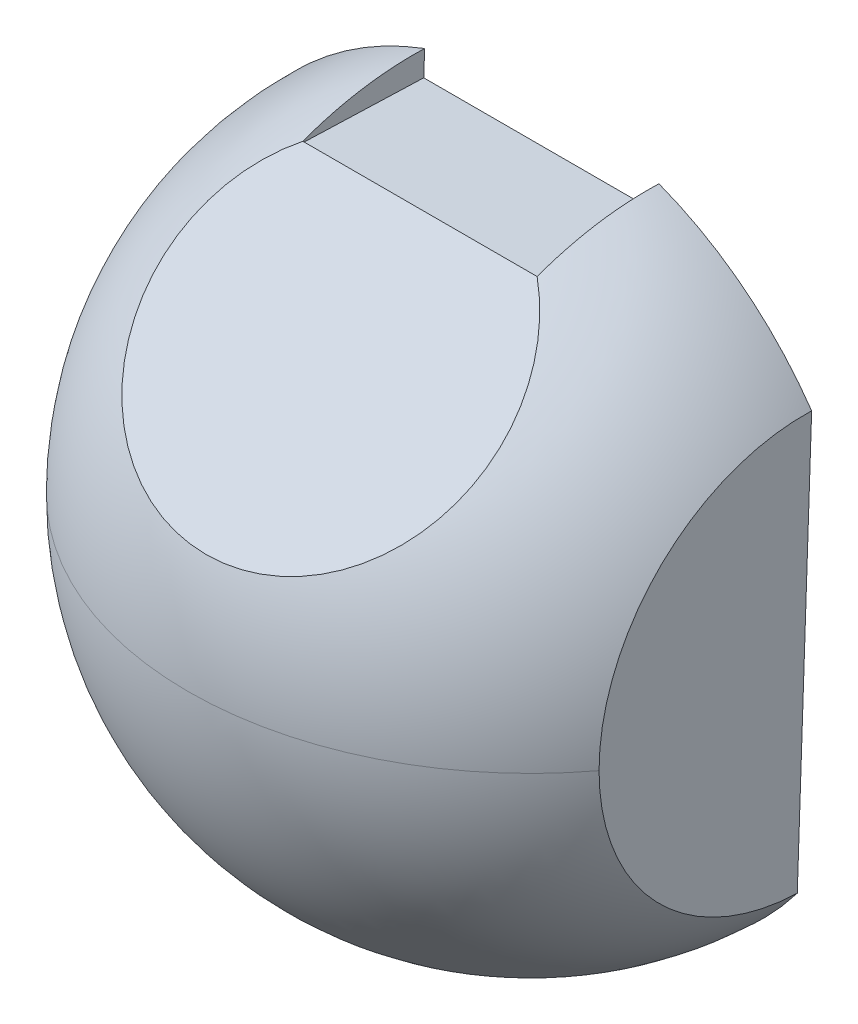
ISO-10303-21;
HEADER;
FILE_DESCRIPTION(('STEP AP214'),'2;1');
FILE_NAME('part.step','',(''),(''),'','','');
FILE_SCHEMA(('AUTOMOTIVE_DESIGN { 1 0 10303 214 1 1 1 1 }'));
ENDSEC;
DATA;
#1=APPLICATION_CONTEXT('core data for automotive mechanical design processes');
#2=APPLICATION_PROTOCOL_DEFINITION('international standard','automotive_design',2000,#1);
#3=PRODUCT_CONTEXT('',#1,'mechanical');
#4=PRODUCT('Part','Part','',(#3));
#5=PRODUCT_RELATED_PRODUCT_CATEGORY('part','',(#4));
#6=PRODUCT_DEFINITION_FORMATION('','',#4);
#7=PRODUCT_DEFINITION_CONTEXT('part definition',#1,'design');
#8=PRODUCT_DEFINITION('design','',#6,#7);
#9=PRODUCT_DEFINITION_SHAPE('','',#8);
#10=(LENGTH_UNIT() NAMED_UNIT(*) SI_UNIT(.MILLI.,.METRE.));
#11=(NAMED_UNIT(*) PLANE_ANGLE_UNIT() SI_UNIT($,.RADIAN.));
#12=(NAMED_UNIT(*) SI_UNIT($,.STERADIAN.) SOLID_ANGLE_UNIT());
#13=UNCERTAINTY_MEASURE_WITH_UNIT(LENGTH_MEASURE(1.E-05),#10,'distance_accuracy_value','');
#14=(GEOMETRIC_REPRESENTATION_CONTEXT(3) GLOBAL_UNCERTAINTY_ASSIGNED_CONTEXT((#13)) GLOBAL_UNIT_ASSIGNED_CONTEXT((#10,
#11,#12)) REPRESENTATION_CONTEXT('',''));
#15=CARTESIAN_POINT('',(0.,0.,0.));
#16=DIRECTION('',(0.,0.,1.));
#17=DIRECTION('',(1.,0.,0.));
#18=AXIS2_PLACEMENT_3D('',#15,#16,#17);
#19=CARTESIAN_POINT('',(14.2598514294531,-20.4423351170931,13.2659633857933));
#20=DIRECTION('',(-9.10736523873779E-05,-0.0350367531214772,-0.999386020332631));
#21=DIRECTION('',(0.,-0.99938602447729,0.0350367532667818));
#22=AXIS2_PLACEMENT_3D('',#19,#20,#21);
#23=PLANE('',#22);
#24=DIRECTION('',(3.19288542979789E-06,-0.999386024482384,0.0350367529760037));
#25=VECTOR('',#24,1.);
#26=CARTESIAN_POINT('',(-14.2574161236256,-25.8338358027963,13.4575788840046));
#27=LINE('',#26,#25);
#28=CARTESIAN_POINT('',(-14.2574161236256,-25.8338358027963,13.4575788840046));
#29=VERTEX_POINT('',#28);
#30=CARTESIAN_POINT('',(-14.2574156103928,-25.994479741968,13.463210783867));
#31=VERTEX_POINT('',#30);
#32=EDGE_CURVE('E253',#29,#31,#27,.T.);
#33=ORIENTED_EDGE('',*,*,#32,.F.);
#34=DIRECTION('',(0.999999995847698,0.,-9.11296037329998E-05));
#35=VECTOR('',#34,1.);
#36=CARTESIAN_POINT('',(14.2598686544728,-25.8338358027963,13.4549801151324));
#37=LINE('',#36,#35);
#38=CARTESIAN_POINT('',(14.2598686544727,-25.8338358027963,13.4549801151324));
#39=VERTEX_POINT('',#38);
#40=EDGE_CURVE('E198',#29,#39,#37,.T.);
#41=ORIENTED_EDGE('',*,*,#40,.T.);
#42=DIRECTION('',(3.19288542979789E-06,-0.999386024482384,0.0350367529760037));
#43=VECTOR('',#42,1.);
#44=CARTESIAN_POINT('',(14.2598686544728,-25.8338358027963,13.4549801151324));
#45=LINE('',#44,#43);
#46=CARTESIAN_POINT('',(14.2598691677056,-25.994479741968,13.4606120149949));
#47=VERTEX_POINT('',#46);
#48=EDGE_CURVE('E213',#39,#47,#45,.T.);
#49=ORIENTED_EDGE('',*,*,#48,.T.);
#50=DIRECTION('',(0.999999995847698,0.,-9.11296037329823E-05));
#51=VECTOR('',#50,1.);
#52=CARTESIAN_POINT('',(-14.2574156103928,-25.994479741968,13.463210783867));
#53=LINE('',#52,#51);
#54=EDGE_CURVE('E217',#31,#47,#53,.T.);
#55=ORIENTED_EDGE('',*,*,#54,.F.);
#56=EDGE_LOOP('',(#33,#41,#49,#55));
#57=FACE_BOUND('',#56,.T.);
#58=ADVANCED_FACE('F49',(#57),#23,.T.);
#59=CARTESIAN_POINT('',(0.,-62.5997275361334,0.));
#60=DIRECTION('',(0.,1.,0.));
#61=DIRECTION('',(1.,0.,0.));
#62=AXIS2_PLACEMENT_3D('',#59,#60,#61);
#63=SPHERICAL_SURFACE('',#62,41.666667);
#64=CARTESIAN_POINT('',(14.2586423890492,-62.5997275361334,-0.00129938443608005));
#65=DIRECTION('',(0.999999995847698,0.,-9.11296037330042E-05));
#66=DIRECTION('',(9.10736523873821E-05,0.0350367531214773,0.999386020332631));
#67=AXIS2_PLACEMENT_3D('',#64,#65,#66);
#68=CIRCLE('',#67,39.1510185617399);
#69=CARTESIAN_POINT('',(14.2585173843326,-23.4727467412801,-1.37302395054232));
#70=VERTEX_POINT('',#69);
#71=EDGE_CURVE('E235',#70,#39,#68,.T.);
#72=ORIENTED_EDGE('',*,*,#71,.T.);
#73=CARTESIAN_POINT('',(0.00221509637557768,-35.6039582636471,24.3070997309474));
#74=DIRECTION('',(6.09776070031096E-05,0.743144825477396,0.669130603580423));
#75=DIRECTION('',(0.,-0.669130604824427,0.743144826859002));
#76=AXIS2_PLACEMENT_3D('',#73,#74,#75);
#77=CIRCLE('',#76,20.4084413427067);
#78=EDGE_CURVE('E11',#39,#29,#77,.F.);
#79=ORIENTED_EDGE('',*,*,#78,.T.);
#80=CARTESIAN_POINT('',(-14.2586423890492,-62.5997275361334,0.00129938443608005));
#81=DIRECTION('',(-0.999999995847698,0.,9.11296037330042E-05));
#82=DIRECTION('',(-9.10736523873821E-05,-0.0350367531214744,-0.999386020332631));
#83=AXIS2_PLACEMENT_3D('',#80,#81,#82);
#84=CIRCLE('',#83,39.1510185617399);
#85=CARTESIAN_POINT('',(-14.2587673937659,-23.4727467412801,-1.37042518167016));
#86=VERTEX_POINT('',#85);
#87=EDGE_CURVE('E190',#29,#86,#84,.T.);
#88=ORIENTED_EDGE('',*,*,#87,.T.);
#89=CARTESIAN_POINT('',(0.,-62.5997275361334,0.));
#90=DIRECTION('',(-9.10736523873779E-05,-0.0350367531214772,-0.999386020332631));
#91=DIRECTION('',(-0.999999995847698,0.,9.1129603733E-05));
#92=AXIS2_PLACEMENT_3D('',#89,#90,#91);
#93=CIRCLE('',#92,41.666667);
#94=CARTESIAN_POINT('',(-33.3334132837263,-37.6150767241966,-0.872881177925133));
#95=VERTEX_POINT('',#94);
#96=EDGE_CURVE('E175',#95,#86,#93,.T.);
#97=ORIENTED_EDGE('',*,*,#96,.F.);
#98=CARTESIAN_POINT('',(-33.3333334615899,-62.5997275361334,0.00303765348206789));
#99=DIRECTION('',(0.999999995847698,0.,-9.11296037329802E-05));
#100=DIRECTION('',(9.10736523873581E-05,0.0350367531214772,0.999386020332631));
#101=AXIS2_PLACEMENT_3D('',#98,#99,#100);
#102=CIRCLE('',#101,25.0000002);
#103=CARTESIAN_POINT('',(-33.3310552214784,-62.5997275361334,25.0030377496745));
#104=VERTEX_POINT('',#103);
#105=EDGE_CURVE('E188',#95,#104,#102,.T.);
#106=ORIENTED_EDGE('',*,*,#105,.T.);
#107=CARTESIAN_POINT('',(0.,-62.5997275361334,0.));
#108=DIRECTION('',(0.,1.,0.));
#109=DIRECTION('',(-1.,0.,0.));
#110=AXIS2_PLACEMENT_3D('',#107,#108,#109);
#111=CIRCLE('',#110,41.666667);
#112=CARTESIAN_POINT('',(0.,-62.5997275361334,41.666667));
#113=VERTEX_POINT('',#112);
#114=EDGE_CURVE('E197',#104,#113,#111,.T.);
#115=ORIENTED_EDGE('',*,*,#114,.T.);
#116=CARTESIAN_POINT('',(0.,-62.5997275361334,0.));
#117=DIRECTION('',(0.,-1.,0.));
#118=DIRECTION('',(0.,0.,-1.));
#119=AXIS2_PLACEMENT_3D('',#116,#117,#118);
#120=CIRCLE('',#119,41.666667);
#121=CARTESIAN_POINT('',(33.3356117017014,-62.5997275361334,24.9969624427104));
#122=VERTEX_POINT('',#121);
#123=EDGE_CURVE('E154',#122,#113,#120,.T.);
#124=ORIENTED_EDGE('',*,*,#123,.F.);
#125=CARTESIAN_POINT('',(33.3333334615899,-62.5997275361334,-0.00303765348206789));
#126=DIRECTION('',(-0.999999995847698,0.,9.11296037329802E-05));
#127=DIRECTION('',(-9.10736523873581E-05,-0.0350367531214774,-0.999386020332631));
#128=AXIS2_PLACEMENT_3D('',#125,#126,#127);
#129=CIRCLE('',#128,25.0000002);
#130=CARTESIAN_POINT('',(33.3332536394536,-37.6150767241966,-0.878956484889268));
#131=VERTEX_POINT('',#130);
#132=EDGE_CURVE('E227',#122,#131,#129,.T.);
#133=ORIENTED_EDGE('',*,*,#132,.T.);
#134=CARTESIAN_POINT('',(0.,-62.5997275361334,0.));
#135=DIRECTION('',(-9.10736523873779E-05,-0.0350367531214772,-0.999386020332631));
#136=DIRECTION('',(-0.999999995847698,0.,9.1129603733E-05));
#137=AXIS2_PLACEMENT_3D('',#134,#135,#136);
#138=CIRCLE('',#137,41.666667);
#139=EDGE_CURVE('E231',#70,#131,#138,.T.);
#140=ORIENTED_EDGE('',*,*,#139,.F.);
#141=EDGE_LOOP('',(#72,#79,#88,#97,#106,#115,#124,#133,#140));
#142=FACE_BOUND('',#141,.T.);
#143=ADVANCED_FACE('F187',(#142),#63,.T.);
#144=CARTESIAN_POINT('',(-0.000199751040257114,-0.0768458022683134,-2.19194456295436));
#145=DIRECTION('',(9.10736523878124E-05,0.0350367531214781,0.999386020332631));
#146=DIRECTION('',(0.9999966216425,-0.00259936599697722,0.));
#147=AXIS2_PLACEMENT_3D('',#144,#145,#146);
#148=PLANE('',#147);
#149=DIRECTION('',(0.999999995852795,-3.19092508804742E-06,-9.10177353944788E-05));
#150=VECTOR('',#149,1.);
#151=CARTESIAN_POINT('',(-16.6977987223002,-46.0227780863122,-0.579637641590468));
#152=LINE('',#151,#150);
#153=CARTESIAN_POINT('',(-16.6977987223002,-46.0227780863122,-0.579637641590467));
#154=VERTEX_POINT('',#153);
#155=CARTESIAN_POINT('',(16.6973992202197,-46.0228846478876,-0.582677196892853));
#156=VERTEX_POINT('',#155);
#157=EDGE_CURVE('E223',#154,#156,#152,.T.);
#158=ORIENTED_EDGE('',*,*,#157,.F.);
#159=DIRECTION('',(0.,0.99938602447729,-0.0350367532667827));
#160=VECTOR('',#159,1.);
#161=CARTESIAN_POINT('',(-16.6977987223002,-79.5294839718656,0.595049774624714));
#162=LINE('',#161,#160);
#163=CARTESIAN_POINT('',(-16.6977987223002,-79.5294839718656,0.595049774624714));
#164=VERTEX_POINT('',#163);
#165=EDGE_CURVE('E248',#164,#154,#162,.T.);
#166=ORIENTED_EDGE('',*,*,#165,.F.);
#167=DIRECTION('',(-0.999999995852795,3.19092508778146E-06,9.10177353944913E-05));
#168=VECTOR('',#167,1.);
#169=CARTESIAN_POINT('',(16.6973992202197,-79.529590533441,0.592010219322329));
#170=LINE('',#169,#168);
#171=CARTESIAN_POINT('',(16.6973992202197,-79.529590533441,0.592010219322329));
#172=VERTEX_POINT('',#171);
#173=EDGE_CURVE('E249',#172,#164,#170,.T.);
#174=ORIENTED_EDGE('',*,*,#173,.F.);
#175=DIRECTION('',(0.,-0.99938602447729,0.0350367532667827));
#176=VECTOR('',#175,1.);
#177=CARTESIAN_POINT('',(16.6973992202197,-46.0228846478876,-0.582677196892853));
#178=LINE('',#177,#176);
#179=EDGE_CURVE('E258',#156,#172,#178,.T.);
#180=ORIENTED_EDGE('',*,*,#179,.F.);
#181=EDGE_LOOP('',(#158,#166,#174,#180));
#182=FACE_BOUND('',#181,.T.);
#183=DIRECTION('',(-3.19288542795622E-06,0.999386024482384,-0.035036752975995));
#184=VECTOR('',#183,1.);
#185=CARTESIAN_POINT('',(14.2585270904078,-26.5107874744469,-1.26651547424648));
#186=LINE('',#185,#184);
#187=CARTESIAN_POINT('',(14.2585270904078,-26.5107874744469,-1.26651547424648));
#188=VERTEX_POINT('',#187);
#189=EDGE_CURVE('E243',#188,#70,#186,.T.);
#190=ORIENTED_EDGE('',*,*,#189,.T.);
#191=ORIENTED_EDGE('',*,*,#139,.T.);
#192=DIRECTION('',(3.19288542799705E-06,-0.999386024482384,0.0350367529759949));
#193=VECTOR('',#192,1.);
#194=CARTESIAN_POINT('',(33.3332536394536,-37.6150767241966,-0.878956484889265));
#195=LINE('',#194,#193);
#196=CARTESIAN_POINT('',(33.3334132837263,-87.5843783480702,0.872881177925136));
#197=VERTEX_POINT('',#196);
#198=EDGE_CURVE('E182',#131,#197,#195,.T.);
#199=ORIENTED_EDGE('',*,*,#198,.T.);
#200=CARTESIAN_POINT('',(0.,-62.5997275361334,0.));
#201=DIRECTION('',(9.1073652387378E-05,0.0350367531214773,0.999386020332631));
#202=DIRECTION('',(-3.19288542805118E-06,0.999386024482384,-0.0350367529759941));
#203=AXIS2_PLACEMENT_3D('',#200,#201,#202);
#204=CIRCLE('',#203,41.666667);
#205=CARTESIAN_POINT('',(-33.3332536394536,-87.5843783480702,0.878956484889271));
#206=VERTEX_POINT('',#205);
#207=EDGE_CURVE('E177',#206,#197,#204,.T.);
#208=ORIENTED_EDGE('',*,*,#207,.F.);
#209=DIRECTION('',(-3.19288542799705E-06,0.999386024482384,-0.0350367529759949));
#210=VECTOR('',#209,1.);
#211=CARTESIAN_POINT('',(-33.3332536394536,-87.5843783480702,0.878956484889346));
#212=LINE('',#211,#210);
#213=EDGE_CURVE('E173',#206,#95,#212,.T.);
#214=ORIENTED_EDGE('',*,*,#213,.T.);
#215=ORIENTED_EDGE('',*,*,#96,.T.);
#216=DIRECTION('',(3.19288542795622E-06,-0.999386024482384,0.0350367529759949));
#217=VECTOR('',#216,1.);
#218=CARTESIAN_POINT('',(-14.2587673937659,-23.4727467412801,-1.37042518167015));
#219=LINE('',#218,#217);
#220=CARTESIAN_POINT('',(-14.2587576876906,-26.5107874744469,-1.26391670537431));
#221=VERTEX_POINT('',#220);
#222=EDGE_CURVE('E226',#86,#221,#219,.T.);
#223=ORIENTED_EDGE('',*,*,#222,.T.);
#224=DIRECTION('',(0.999999995847698,0.,-9.112960373343E-05));
#225=VECTOR('',#224,1.);
#226=CARTESIAN_POINT('',(-14.2587576876906,-26.5107874744469,-1.26391670537431));
#227=LINE('',#226,#225);
#228=EDGE_CURVE('E59',#221,#188,#227,.T.);
#229=ORIENTED_EDGE('',*,*,#228,.T.);
#230=EDGE_LOOP('',(#190,#191,#199,#208,#214,#215,#223,#229));
#231=FACE_BOUND('',#230,.T.);
#232=ADVANCED_FACE('F51',(#182,#231),#148,.F.);
#233=CARTESIAN_POINT('',(-0.000115298641379792,-26.5107874744469,-1.2652160898104));
#234=DIRECTION('',(-3.19288542805117E-06,0.999386024482384,-0.035036752975994));
#235=DIRECTION('',(-0.999999995847698,0.,9.11296037330001E-05));
#236=AXIS2_PLACEMENT_3D('',#233,#234,#235);
#237=PLANE('',#236);
#238=ORIENTED_EDGE('',*,*,#228,.F.);
#239=DIRECTION('',(9.10736523873574E-05,0.0350367531214773,0.999386020332631));
#240=VECTOR('',#239,1.);
#241=CARTESIAN_POINT('',(-14.2587576876906,-26.5107874744469,-1.2639167053743));
#242=LINE('',#241,#240);
#243=EDGE_CURVE('E218',#221,#31,#242,.T.);
#244=ORIENTED_EDGE('',*,*,#243,.T.);
#245=ORIENTED_EDGE('',*,*,#54,.T.);
#246=DIRECTION('',(-9.10736523873573E-05,-0.0350367531214772,-0.999386020332631));
#247=VECTOR('',#246,1.);
#248=CARTESIAN_POINT('',(14.2598691677056,-25.994479741968,13.4606120149949));
#249=LINE('',#248,#247);
#250=EDGE_CURVE('E267',#47,#188,#249,.T.);
#251=ORIENTED_EDGE('',*,*,#250,.T.);
#252=EDGE_LOOP('',(#238,#244,#245,#251));
#253=FACE_BOUND('',#252,.T.);
#254=ADVANCED_FACE('F397',(#253),#237,.T.);
#255=CARTESIAN_POINT('',(14.2598514294531,-20.4423351170931,13.2659633857933));
#256=DIRECTION('',(-0.999999995847698,0.,9.1129603733E-05));
#257=DIRECTION('',(0.,1.,0.));
#258=AXIS2_PLACEMENT_3D('',#255,#256,#257);
#259=PLANE('',#258);
#260=ORIENTED_EDGE('',*,*,#189,.F.);
#261=ORIENTED_EDGE('',*,*,#250,.F.);
#262=ORIENTED_EDGE('',*,*,#48,.F.);
#263=ORIENTED_EDGE('',*,*,#71,.F.);
#264=EDGE_LOOP('',(#260,#261,#262,#263));
#265=FACE_BOUND('',#264,.T.);
#266=ADVANCED_FACE('F294',(#265),#259,.T.);
#267=CARTESIAN_POINT('',(-14.2574333486454,-20.4423351170931,13.2685621546654));
#268=DIRECTION('',(0.999999995847698,0.,-9.1129603733E-05));
#269=DIRECTION('',(0.,-1.,0.));
#270=AXIS2_PLACEMENT_3D('',#267,#268,#269);
#271=PLANE('',#270);
#272=ORIENTED_EDGE('',*,*,#222,.F.);
#273=ORIENTED_EDGE('',*,*,#87,.F.);
#274=ORIENTED_EDGE('',*,*,#32,.T.);
#275=ORIENTED_EDGE('',*,*,#243,.F.);
#276=EDGE_LOOP('',(#272,#273,#274,#275));
#277=FACE_BOUND('',#276,.T.);
#278=ADVANCED_FACE('F412',(#277),#271,.T.);
#279=CARTESIAN_POINT('',(33.3333334615899,-62.5997275361334,-0.00303765348206789));
#280=DIRECTION('',(0.999999995847698,0.,-9.1129603733E-05));
#281=DIRECTION('',(0.,-1.,0.));
#282=AXIS2_PLACEMENT_3D('',#279,#280,#281);
#283=PLANE('',#282);
#284=ORIENTED_EDGE('',*,*,#198,.F.);
#285=ORIENTED_EDGE('',*,*,#132,.F.);
#286=CARTESIAN_POINT('',(33.3333334615899,-62.5997275361334,-0.00303765348206789));
#287=DIRECTION('',(-0.999999995847698,0.,9.11296037329802E-05));
#288=DIRECTION('',(-9.10736523873581E-05,-0.0350367531214774,-0.999386020332631));
#289=AXIS2_PLACEMENT_3D('',#286,#287,#288);
#290=CIRCLE('',#289,25.0000002);
#291=EDGE_CURVE('E146',#197,#122,#290,.T.);
#292=ORIENTED_EDGE('',*,*,#291,.F.);
#293=EDGE_LOOP('',(#284,#285,#292));
#294=FACE_BOUND('',#293,.T.);
#295=ADVANCED_FACE('F296',(#294),#283,.T.);
#296=CARTESIAN_POINT('',(-33.3333334615899,-62.5997275361334,0.00303765348206789));
#297=DIRECTION('',(-0.999999995847698,0.,9.1129603733E-05));
#298=DIRECTION('',(0.,1.,0.));
#299=AXIS2_PLACEMENT_3D('',#296,#297,#298);
#300=PLANE('',#299);
#301=ORIENTED_EDGE('',*,*,#213,.F.);
#302=CARTESIAN_POINT('',(-33.3333334615899,-62.5997275361334,0.00303765348206789));
#303=DIRECTION('',(0.999999995847698,0.,-9.11296037329802E-05));
#304=DIRECTION('',(9.10736523873581E-05,0.0350367531214772,0.999386020332631));
#305=AXIS2_PLACEMENT_3D('',#302,#303,#304);
#306=CIRCLE('',#305,25.0000002);
#307=EDGE_CURVE('E195',#104,#206,#306,.T.);
#308=ORIENTED_EDGE('',*,*,#307,.F.);
#309=ORIENTED_EDGE('',*,*,#105,.F.);
#310=EDGE_LOOP('',(#301,#308,#309));
#311=FACE_BOUND('',#310,.T.);
#312=ADVANCED_FACE('F194',(#311),#300,.T.);
#313=CARTESIAN_POINT('',(0.,-62.5997275361334,0.));
#314=DIRECTION('',(0.,1.,0.));
#315=DIRECTION('',(1.,0.,0.));
#316=AXIS2_PLACEMENT_3D('',#313,#314,#315);
#317=SPHERICAL_SURFACE('',#316,41.666667);
#318=ORIENTED_EDGE('',*,*,#114,.F.);
#319=ORIENTED_EDGE('',*,*,#307,.T.);
#320=ORIENTED_EDGE('',*,*,#207,.T.);
#321=ORIENTED_EDGE('',*,*,#291,.T.);
#322=ORIENTED_EDGE('',*,*,#123,.T.);
#323=EDGE_LOOP('',(#318,#319,#320,#321,#322));
#324=FACE_BOUND('',#323,.T.);
#325=ADVANCED_FACE('F297',(#324),#317,.T.);
#326=CARTESIAN_POINT('',(-16.6973433540382,-45.8475943207048,4.41729246007269));
#327=DIRECTION('',(-0.999999995852795,3.19092508781652E-06,9.10177353944825E-05));
#328=DIRECTION('',(3.19092510103369E-06,0.999999999994909,0.));
#329=AXIS2_PLACEMENT_3D('',#326,#327,#328);
#330=PLANE('',#329);
#331=ORIENTED_EDGE('',*,*,#165,.T.);
#332=DIRECTION('',(-9.10736523875855E-05,-0.0350367531214779,-0.999386020332631));
#333=VECTOR('',#332,1.);
#334=CARTESIAN_POINT('',(-16.6973433540382,-45.8475943207048,4.41729246007269));
#335=LINE('',#334,#333);
#336=CARTESIAN_POINT('',(-16.6973433540382,-45.8475943207048,4.41729246007269));
#337=VERTEX_POINT('',#336);
#338=EDGE_CURVE('E207',#337,#154,#335,.T.);
#339=ORIENTED_EDGE('',*,*,#338,.F.);
#340=DIRECTION('',(0.,0.99938602447729,-0.0350367532667827));
#341=VECTOR('',#340,1.);
#342=CARTESIAN_POINT('',(-16.6973433540382,-79.3543002062582,5.59197987628787));
#343=LINE('',#342,#341);
#344=CARTESIAN_POINT('',(-16.6973433540382,-79.3543002062582,5.59197987628787));
#345=VERTEX_POINT('',#344);
#346=EDGE_CURVE('E192',#345,#337,#343,.T.);
#347=ORIENTED_EDGE('',*,*,#346,.F.);
#348=DIRECTION('',(-9.10736523875855E-05,-0.0350367531214797,-0.999386020332631));
#349=VECTOR('',#348,1.);
#350=CARTESIAN_POINT('',(-16.6973433540382,-79.3543002062582,5.59197987628787));
#351=LINE('',#350,#349);
#352=EDGE_CURVE('E244',#345,#164,#351,.T.);
#353=ORIENTED_EDGE('',*,*,#352,.T.);
#354=EDGE_LOOP('',(#331,#339,#347,#353));
#355=FACE_BOUND('',#354,.T.);
#356=ADVANCED_FACE('F325',(#355),#330,.F.);
#357=CARTESIAN_POINT('',(16.6978545884816,-79.3544067678336,5.58894032098549));
#358=DIRECTION('',(0.,-0.99938602447729,0.0350367532667827));
#359=DIRECTION('',(-1.,0.,0.));
#360=AXIS2_PLACEMENT_3D('',#357,#358,#359);
#361=PLANE('',#360);
#362=ORIENTED_EDGE('',*,*,#173,.T.);
#363=ORIENTED_EDGE('',*,*,#352,.F.);
#364=DIRECTION('',(-0.999999995852795,3.19092508804742E-06,9.1017735394483E-05));
#365=VECTOR('',#364,1.);
#366=CARTESIAN_POINT('',(16.6978545884816,-79.3544067678336,5.58894032098549));
#367=LINE('',#366,#365);
#368=CARTESIAN_POINT('',(16.6978545884816,-79.3544067678336,5.58894032098549));
#369=VERTEX_POINT('',#368);
#370=EDGE_CURVE('E239',#369,#345,#367,.T.);
#371=ORIENTED_EDGE('',*,*,#370,.F.);
#372=DIRECTION('',(-9.10736523875855E-05,-0.0350367531214779,-0.999386020332631));
#373=VECTOR('',#372,1.);
#374=CARTESIAN_POINT('',(16.6978545884816,-79.3544067678336,5.58894032098549));
#375=LINE('',#374,#373);
#376=EDGE_CURVE('E254',#369,#172,#375,.T.);
#377=ORIENTED_EDGE('',*,*,#376,.T.);
#378=EDGE_LOOP('',(#362,#363,#371,#377));
#379=FACE_BOUND('',#378,.T.);
#380=ADVANCED_FACE('F323',(#379),#361,.F.);
#381=CARTESIAN_POINT('',(16.6978545884816,-45.8477008822802,4.4142529047703));
#382=DIRECTION('',(0.999999995852795,-3.19092508781653E-06,-9.10177353944825E-05));
#383=DIRECTION('',(0.,-0.99938602447729,0.0350367532667828));
#384=AXIS2_PLACEMENT_3D('',#381,#382,#383);
#385=PLANE('',#384);
#386=ORIENTED_EDGE('',*,*,#179,.T.);
#387=ORIENTED_EDGE('',*,*,#376,.F.);
#388=DIRECTION('',(0.,-0.99938602447729,0.0350367532667827));
#389=VECTOR('',#388,1.);
#390=CARTESIAN_POINT('',(16.6978545884816,-45.8477008822802,4.4142529047703));
#391=LINE('',#390,#389);
#392=CARTESIAN_POINT('',(16.6978545884816,-45.8477008822802,4.4142529047703));
#393=VERTEX_POINT('',#392);
#394=EDGE_CURVE('E273',#393,#369,#391,.T.);
#395=ORIENTED_EDGE('',*,*,#394,.F.);
#396=DIRECTION('',(-9.10736523875855E-05,-0.0350367531214797,-0.999386020332631));
#397=VECTOR('',#396,1.);
#398=CARTESIAN_POINT('',(16.6978545884816,-45.8477008822802,4.4142529047703));
#399=LINE('',#398,#397);
#400=EDGE_CURVE('E219',#393,#156,#399,.T.);
#401=ORIENTED_EDGE('',*,*,#400,.T.);
#402=EDGE_LOOP('',(#386,#387,#395,#401));
#403=FACE_BOUND('',#402,.T.);
#404=ADVANCED_FACE('F320',(#403),#385,.F.);
#405=CARTESIAN_POINT('',(16.6978545884816,-45.8477008822802,4.4142529047703));
#406=DIRECTION('',(0.,0.99938602447729,-0.0350367532667827));
#407=DIRECTION('',(-1.,0.,0.));
#408=AXIS2_PLACEMENT_3D('',#405,#406,#407);
#409=PLANE('',#408);
#410=ORIENTED_EDGE('',*,*,#157,.T.);
#411=ORIENTED_EDGE('',*,*,#400,.F.);
#412=DIRECTION('',(0.999999995852795,-3.19092508778146E-06,-9.10177353944664E-05));
#413=VECTOR('',#412,1.);
#414=CARTESIAN_POINT('',(-16.6973433540382,-45.8475943207048,4.41729246007269));
#415=LINE('',#414,#413);
#416=EDGE_CURVE('E212',#337,#393,#415,.T.);
#417=ORIENTED_EDGE('',*,*,#416,.F.);
#418=ORIENTED_EDGE('',*,*,#338,.T.);
#419=EDGE_LOOP('',(#410,#411,#417,#418));
#420=FACE_BOUND('',#419,.T.);
#421=ADVANCED_FACE('F317',(#420),#409,.F.);
#422=CARTESIAN_POINT('',(0.000255617221681926,0.098337963339077,2.8049855387088));
#423=DIRECTION('',(-9.10736523878223E-05,-0.0350367531214781,-0.999386020332631));
#424=DIRECTION('',(0.,-0.99938602447729,0.0350367532667827));
#425=AXIS2_PLACEMENT_3D('',#422,#423,#424);
#426=PLANE('',#425);
#427=ORIENTED_EDGE('',*,*,#346,.T.);
#428=ORIENTED_EDGE('',*,*,#416,.T.);
#429=ORIENTED_EDGE('',*,*,#394,.T.);
#430=ORIENTED_EDGE('',*,*,#370,.T.);
#431=EDGE_LOOP('',(#427,#428,#429,#430));
#432=FACE_BOUND('',#431,.T.);
#433=ADVANCED_FACE('F312',(#432),#426,.T.);
#434=CARTESIAN_POINT('',(-0.000621622366628217,-7.57582115574353,-6.82129997918446));
#435=DIRECTION('',(6.09776070031096E-05,0.743144825477396,0.669130603580423));
#436=DIRECTION('',(0.,-0.669130604824427,0.743144826859002));
#437=AXIS2_PLACEMENT_3D('',#434,#435,#436);
#438=PLANE('',#437);
#439=ORIENTED_EDGE('',*,*,#78,.F.);
#440=ORIENTED_EDGE('',*,*,#40,.F.);
#441=EDGE_LOOP('',(#439,#440));
#442=FACE_BOUND('',#441,.T.);
#443=ADVANCED_FACE('F449',(#442),#438,.T.);
#444=CLOSED_SHELL('',(#58,#143,#232,#254,#266,#278,#295,#312,#325,#356,#380,#404,#421,#433,#443));
#445=MANIFOLD_SOLID_BREP('B2',#444);
#446=ADVANCED_BREP_SHAPE_REPRESENTATION('',(#18,#445),#14);
#447=SHAPE_DEFINITION_REPRESENTATION(#9,#446);
ENDSEC;
END-ISO-10303-21;
